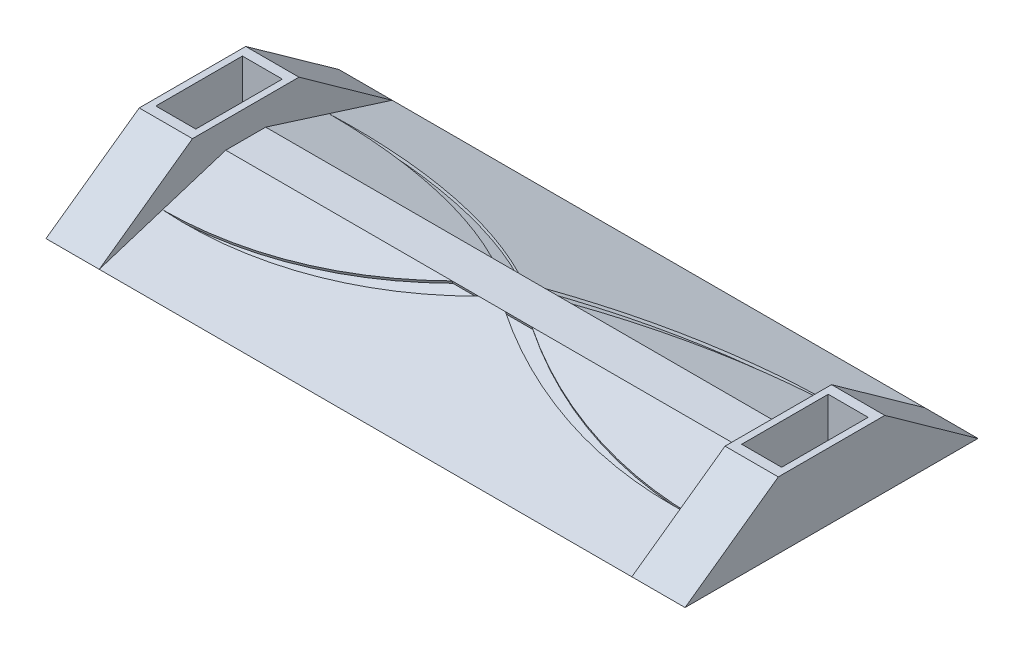
ISO-10303-21;
HEADER;
FILE_DESCRIPTION(('STEP AP214'),'2;1');
FILE_NAME('part.step','',(''),(''),'','','');
FILE_SCHEMA(('AUTOMOTIVE_DESIGN { 1 0 10303 214 1 1 1 1 }'));
ENDSEC;
DATA;
#1=APPLICATION_CONTEXT('core data for automotive mechanical design processes');
#2=APPLICATION_PROTOCOL_DEFINITION('international standard','automotive_design',2000,#1);
#3=PRODUCT_CONTEXT('',#1,'mechanical');
#4=PRODUCT('Part','Part','',(#3));
#5=PRODUCT_RELATED_PRODUCT_CATEGORY('part','',(#4));
#6=PRODUCT_DEFINITION_FORMATION('','',#4);
#7=PRODUCT_DEFINITION_CONTEXT('part definition',#1,'design');
#8=PRODUCT_DEFINITION('design','',#6,#7);
#9=PRODUCT_DEFINITION_SHAPE('','',#8);
#10=(LENGTH_UNIT() NAMED_UNIT(*) SI_UNIT(.MILLI.,.METRE.));
#11=(NAMED_UNIT(*) PLANE_ANGLE_UNIT() SI_UNIT($,.RADIAN.));
#12=(NAMED_UNIT(*) SI_UNIT($,.STERADIAN.) SOLID_ANGLE_UNIT());
#13=UNCERTAINTY_MEASURE_WITH_UNIT(LENGTH_MEASURE(1.E-05),#10,'distance_accuracy_value','');
#14=(GEOMETRIC_REPRESENTATION_CONTEXT(3) GLOBAL_UNCERTAINTY_ASSIGNED_CONTEXT((#13)) GLOBAL_UNIT_ASSIGNED_CONTEXT((#10,
#11,#12)) REPRESENTATION_CONTEXT('',''));
#15=CARTESIAN_POINT('',(0.,0.,0.));
#16=DIRECTION('',(0.,0.,1.));
#17=DIRECTION('',(1.,0.,0.));
#18=AXIS2_PLACEMENT_3D('',#15,#16,#17);
#19=CARTESIAN_POINT('',(100.,0.,-55.0000000000001));
#20=DIRECTION('',(0.,-0.953582665134142,0.301131367937097));
#21=DIRECTION('',(0.,-0.301131367937097,-0.953582665134142));
#22=AXIS2_PLACEMENT_3D('',#19,#20,#21);
#23=PLANE('',#22);
#24=DIRECTION('',(-1.,0.,0.));
#25=VECTOR('',#24,1.);
#26=CARTESIAN_POINT('',(100.,15.,-7.50000000000002));
#27=LINE('',#26,#25);
#28=CARTESIAN_POINT('',(5.,15.,-7.5));
#29=VERTEX_POINT('',#28);
#30=CARTESIAN_POINT('',(-5.,15.,-7.5));
#31=VERTEX_POINT('',#30);
#32=EDGE_CURVE('E459',#29,#31,#27,.T.);
#33=ORIENTED_EDGE('',*,*,#32,.F.);
#34=CARTESIAN_POINT('',(91.1175797884145,55.6067163312771,121.087935049044));
#35=DIRECTION('',(0.,0.953582665134142,-0.301131367937097));
#36=DIRECTION('',(0.,-0.301131367937097,-0.953582665134142));
#37=AXIS2_PLACEMENT_3D('',#34,#35,#36);
#38=CIRCLE('',#37,160.);
#39=CARTESIAN_POINT('',(100.,7.50000000000001,-31.25));
#40=VERTEX_POINT('',#39);
#41=EDGE_CURVE('E57',#40,#29,#38,.T.);
#42=ORIENTED_EDGE('',*,*,#41,.F.);
#43=DIRECTION('',(0.,0.301131367937097,0.953582665134142));
#44=VECTOR('',#43,1.);
#45=CARTESIAN_POINT('',(100.,0.,-55.0000000000001));
#46=LINE('',#45,#44);
#47=CARTESIAN_POINT('',(100.,0.,-55.));
#48=VERTEX_POINT('',#47);
#49=EDGE_CURVE('E446',#48,#40,#46,.T.);
#50=ORIENTED_EDGE('',*,*,#49,.F.);
#51=DIRECTION('',(-1.,0.,0.));
#52=VECTOR('',#51,1.);
#53=CARTESIAN_POINT('',(100.,0.,-55.0000000000001));
#54=LINE('',#53,#52);
#55=CARTESIAN_POINT('',(-100.,0.,-55.));
#56=VERTEX_POINT('',#55);
#57=EDGE_CURVE('E449',#48,#56,#54,.T.);
#58=ORIENTED_EDGE('',*,*,#57,.T.);
#59=DIRECTION('',(0.,0.301131367937097,0.953582665134142));
#60=VECTOR('',#59,1.);
#61=CARTESIAN_POINT('',(-100.,0.,-55.));
#62=LINE('',#61,#60);
#63=CARTESIAN_POINT('',(-100.,7.50000000000001,-31.25));
#64=VERTEX_POINT('',#63);
#65=EDGE_CURVE('E451',#56,#64,#62,.T.);
#66=ORIENTED_EDGE('',*,*,#65,.T.);
#67=CARTESIAN_POINT('',(-91.1175797884146,55.6067163312771,121.087935049044));
#68=DIRECTION('',(0.,0.953582665134142,-0.301131367937097));
#69=DIRECTION('',(0.,0.301131367937097,0.953582665134142));
#70=AXIS2_PLACEMENT_3D('',#67,#68,#69);
#71=CIRCLE('',#70,160.);
#72=EDGE_CURVE('E266',#31,#64,#71,.T.);
#73=ORIENTED_EDGE('',*,*,#72,.F.);
#74=EDGE_LOOP('',(#33,#42,#50,#58,#66,#73));
#75=FACE_BOUND('',#74,.T.);
#76=ADVANCED_FACE('F32',(#75),#23,.F.);
#77=CARTESIAN_POINT('',(-15.,15.,-7.5));
#78=VERTEX_POINT('',#77);
#79=CARTESIAN_POINT('',(-100.,15.,-7.49999999999997));
#80=VERTEX_POINT('',#79);
#81=EDGE_CURVE('E460',#78,#80,#27,.T.);
#82=ORIENTED_EDGE('',*,*,#81,.F.);
#83=CARTESIAN_POINT('',(-100.732632267828,55.6805137664325,121.321626927036));
#84=DIRECTION('',(0.,-0.953582665134142,0.301131367937097));
#85=DIRECTION('',(0.,0.301131367937097,0.953582665134142));
#86=AXIS2_PLACEMENT_3D('',#83,#84,#85);
#87=CIRCLE('',#86,160.);
#88=EDGE_CURVE('E49',#64,#78,#87,.T.);
#89=ORIENTED_EDGE('',*,*,#88,.F.);
#90=EDGE_CURVE('E454',#64,#80,#62,.T.);
#91=ORIENTED_EDGE('',*,*,#90,.T.);
#92=EDGE_LOOP('',(#82,#89,#91));
#93=FACE_BOUND('',#92,.T.);
#94=ADVANCED_FACE('F545',(#93),#23,.F.);
#95=CARTESIAN_POINT('',(100.,15.,7.49999999999997));
#96=DIRECTION('',(0.,-0.953582665134142,-0.301131367937098));
#97=DIRECTION('',(0.,0.301131367937098,-0.953582665134141));
#98=AXIS2_PLACEMENT_3D('',#95,#96,#97);
#99=PLANE('',#98);
#100=DIRECTION('',(-1.,0.,0.));
#101=VECTOR('',#100,1.);
#102=CARTESIAN_POINT('',(100.,15.,7.49999999999997));
#103=LINE('',#102,#101);
#104=CARTESIAN_POINT('',(5.,15.,7.50000000000001));
#105=VERTEX_POINT('',#104);
#106=CARTESIAN_POINT('',(-5.,15.,7.5));
#107=VERTEX_POINT('',#106);
#108=EDGE_CURVE('E474',#105,#107,#103,.T.);
#109=ORIENTED_EDGE('',*,*,#108,.T.);
#110=CARTESIAN_POINT('',(-91.1175797884146,55.6067163312772,-121.087935049044));
#111=DIRECTION('',(0.,0.953582665134142,0.301131367937098));
#112=DIRECTION('',(0.,0.301131367937098,-0.953582665134142));
#113=AXIS2_PLACEMENT_3D('',#110,#111,#112);
#114=CIRCLE('',#113,160.);
#115=CARTESIAN_POINT('',(-100.,7.49999999999999,31.2500000000001));
#116=VERTEX_POINT('',#115);
#117=EDGE_CURVE('E294',#116,#107,#114,.T.);
#118=ORIENTED_EDGE('',*,*,#117,.F.);
#119=DIRECTION('',(0.,-0.301131367937098,0.953582665134142));
#120=VECTOR('',#119,1.);
#121=CARTESIAN_POINT('',(-100.,15.,7.50000000000002));
#122=LINE('',#121,#120);
#123=CARTESIAN_POINT('',(-100.,0.,55.));
#124=VERTEX_POINT('',#123);
#125=EDGE_CURVE('E445',#116,#124,#122,.T.);
#126=ORIENTED_EDGE('',*,*,#125,.T.);
#127=DIRECTION('',(1.,0.,0.));
#128=VECTOR('',#127,1.);
#129=CARTESIAN_POINT('',(-100.,0.,55.));
#130=LINE('',#129,#128);
#131=CARTESIAN_POINT('',(100.,0.,55.));
#132=VERTEX_POINT('',#131);
#133=EDGE_CURVE('E36',#124,#132,#130,.T.);
#134=ORIENTED_EDGE('',*,*,#133,.T.);
#135=DIRECTION('',(0.,-0.301131367937098,0.953582665134142));
#136=VECTOR('',#135,1.);
#137=CARTESIAN_POINT('',(100.,15.,7.49999999999997));
#138=LINE('',#137,#136);
#139=CARTESIAN_POINT('',(100.,7.49999999999998,31.25));
#140=VERTEX_POINT('',#139);
#141=EDGE_CURVE('E467',#140,#132,#138,.T.);
#142=ORIENTED_EDGE('',*,*,#141,.F.);
#143=CARTESIAN_POINT('',(91.1175797884145,55.6067163312772,-121.087935049044));
#144=DIRECTION('',(0.,0.953582665134142,0.301131367937098));
#145=DIRECTION('',(0.,-0.301131367937098,0.953582665134142));
#146=AXIS2_PLACEMENT_3D('',#143,#144,#145);
#147=CIRCLE('',#146,160.);
#148=EDGE_CURVE('E260',#105,#140,#147,.T.);
#149=ORIENTED_EDGE('',*,*,#148,.F.);
#150=EDGE_LOOP('',(#109,#118,#126,#134,#142,#149));
#151=FACE_BOUND('',#150,.T.);
#152=ADVANCED_FACE('F491',(#151),#99,.F.);
#153=CARTESIAN_POINT('',(-100.,15.,7.50000000000002));
#154=VERTEX_POINT('',#153);
#155=EDGE_CURVE('E468',#154,#116,#122,.T.);
#156=ORIENTED_EDGE('',*,*,#155,.T.);
#157=CARTESIAN_POINT('',(-100.732632267828,55.6805137664326,-121.321626927036));
#158=DIRECTION('',(0.,-0.953582665134142,-0.301131367937098));
#159=DIRECTION('',(0.,-0.301131367937098,0.953582665134142));
#160=AXIS2_PLACEMENT_3D('',#157,#158,#159);
#161=CIRCLE('',#160,160.);
#162=CARTESIAN_POINT('',(-15.,15.,7.50000000000001));
#163=VERTEX_POINT('',#162);
#164=EDGE_CURVE('E287',#163,#116,#161,.T.);
#165=ORIENTED_EDGE('',*,*,#164,.F.);
#166=EDGE_CURVE('E466',#163,#154,#103,.T.);
#167=ORIENTED_EDGE('',*,*,#166,.T.);
#168=EDGE_LOOP('',(#156,#165,#167));
#169=FACE_BOUND('',#168,.T.);
#170=ADVANCED_FACE('F595',(#169),#99,.F.);
#171=CARTESIAN_POINT('',(100.,15.,7.49999999999997));
#172=VERTEX_POINT('',#171);
#173=CARTESIAN_POINT('',(15.,15.,7.50000000000001));
#174=VERTEX_POINT('',#173);
#175=EDGE_CURVE('E471',#172,#174,#103,.T.);
#176=ORIENTED_EDGE('',*,*,#175,.T.);
#177=CARTESIAN_POINT('',(100.732632267828,55.6805137664326,-121.321626927036));
#178=DIRECTION('',(0.,-0.953582665134142,-0.301131367937098));
#179=DIRECTION('',(0.,-0.301131367937098,0.953582665134142));
#180=AXIS2_PLACEMENT_3D('',#177,#178,#179);
#181=CIRCLE('',#180,160.);
#182=EDGE_CURVE('E321',#140,#174,#181,.T.);
#183=ORIENTED_EDGE('',*,*,#182,.F.);
#184=EDGE_CURVE('E463',#172,#140,#138,.T.);
#185=ORIENTED_EDGE('',*,*,#184,.F.);
#186=EDGE_LOOP('',(#176,#183,#185));
#187=FACE_BOUND('',#186,.T.);
#188=ADVANCED_FACE('F515',(#187),#99,.F.);
#189=CARTESIAN_POINT('',(0.,15.,0.));
#190=DIRECTION('',(0.,1.,0.));
#191=DIRECTION('',(0.,0.,1.));
#192=AXIS2_PLACEMENT_3D('',#189,#190,#191);
#193=PLANE('',#192);
#194=CARTESIAN_POINT('',(100.,15.,-7.49999999999997));
#195=VERTEX_POINT('',#194);
#196=CARTESIAN_POINT('',(15.,15.,-7.50000000000003));
#197=VERTEX_POINT('',#196);
#198=EDGE_CURVE('E455',#195,#197,#27,.T.);
#199=ORIENTED_EDGE('',*,*,#198,.T.);
#200=DIRECTION('',(1.,0.,0.));
#201=VECTOR('',#200,1.);
#202=CARTESIAN_POINT('',(15.,15.,-7.5));
#203=LINE('',#202,#201);
#204=EDGE_CURVE('E251',#29,#197,#203,.T.);
#205=ORIENTED_EDGE('',*,*,#204,.F.);
#206=ORIENTED_EDGE('',*,*,#32,.T.);
#207=DIRECTION('',(1.,0.,0.));
#208=VECTOR('',#207,1.);
#209=CARTESIAN_POINT('',(-5.,15.,-7.5));
#210=LINE('',#209,#208);
#211=EDGE_CURVE('E274',#78,#31,#210,.T.);
#212=ORIENTED_EDGE('',*,*,#211,.F.);
#213=ORIENTED_EDGE('',*,*,#81,.T.);
#214=DIRECTION('',(0.,0.,1.));
#215=VECTOR('',#214,1.);
#216=CARTESIAN_POINT('',(-100.,15.,-55.));
#217=LINE('',#216,#215);
#218=EDGE_CURVE('E11',#80,#154,#217,.T.);
#219=ORIENTED_EDGE('',*,*,#218,.T.);
#220=ORIENTED_EDGE('',*,*,#166,.F.);
#221=DIRECTION('',(-1.,0.,0.));
#222=VECTOR('',#221,1.);
#223=CARTESIAN_POINT('',(-15.,15.,7.50000000000001));
#224=LINE('',#223,#222);
#225=EDGE_CURVE('E296',#107,#163,#224,.T.);
#226=ORIENTED_EDGE('',*,*,#225,.F.);
#227=ORIENTED_EDGE('',*,*,#108,.F.);
#228=DIRECTION('',(-1.,0.,0.));
#229=VECTOR('',#228,1.);
#230=CARTESIAN_POINT('',(5.,15.,7.50000000000001));
#231=LINE('',#230,#229);
#232=EDGE_CURVE('E313',#174,#105,#231,.T.);
#233=ORIENTED_EDGE('',*,*,#232,.F.);
#234=ORIENTED_EDGE('',*,*,#175,.F.);
#235=DIRECTION('',(0.,0.,-1.));
#236=VECTOR('',#235,1.);
#237=CARTESIAN_POINT('',(100.,15.,-55.));
#238=LINE('',#237,#236);
#239=EDGE_CURVE('E41',#172,#195,#238,.T.);
#240=ORIENTED_EDGE('',*,*,#239,.T.);
#241=EDGE_LOOP('',(#199,#205,#206,#212,#213,#219,#220,#226,#227,#233,#234,#240));
#242=FACE_BOUND('',#241,.T.);
#243=ADVANCED_FACE('F518',(#242),#193,.T.);
#244=CARTESIAN_POINT('',(0.,0.,0.));
#245=DIRECTION('',(0.,1.,0.));
#246=DIRECTION('',(0.,0.,1.));
#247=AXIS2_PLACEMENT_3D('',#244,#245,#246);
#248=PLANE('',#247);
#249=DIRECTION('',(-1.,0.,0.));
#250=VECTOR('',#249,1.);
#251=CARTESIAN_POINT('',(-100.,0.,-55.));
#252=LINE('',#251,#250);
#253=CARTESIAN_POINT('',(120.,0.,-55.));
#254=VERTEX_POINT('',#253);
#255=EDGE_CURVE('E477',#254,#48,#252,.T.);
#256=ORIENTED_EDGE('',*,*,#255,.F.);
#257=DIRECTION('',(0.,0.,-1.));
#258=VECTOR('',#257,1.);
#259=CARTESIAN_POINT('',(120.,0.,55.));
#260=LINE('',#259,#258);
#261=CARTESIAN_POINT('',(120.,0.,55.));
#262=VERTEX_POINT('',#261);
#263=EDGE_CURVE('E433',#262,#254,#260,.T.);
#264=ORIENTED_EDGE('',*,*,#263,.F.);
#265=EDGE_CURVE('E479',#132,#262,#130,.T.);
#266=ORIENTED_EDGE('',*,*,#265,.F.);
#267=ORIENTED_EDGE('',*,*,#133,.F.);
#268=DIRECTION('',(1.,0.,0.));
#269=VECTOR('',#268,1.);
#270=CARTESIAN_POINT('',(-120.,0.,55.));
#271=LINE('',#270,#269);
#272=CARTESIAN_POINT('',(-120.,0.,55.));
#273=VERTEX_POINT('',#272);
#274=EDGE_CURVE('E399',#273,#124,#271,.T.);
#275=ORIENTED_EDGE('',*,*,#274,.F.);
#276=DIRECTION('',(0.,0.,1.));
#277=VECTOR('',#276,1.);
#278=CARTESIAN_POINT('',(-120.,0.,-55.));
#279=LINE('',#278,#277);
#280=CARTESIAN_POINT('',(-120.,0.,-55.));
#281=VERTEX_POINT('',#280);
#282=EDGE_CURVE('E393',#281,#273,#279,.T.);
#283=ORIENTED_EDGE('',*,*,#282,.F.);
#284=DIRECTION('',(1.,0.,0.));
#285=VECTOR('',#284,1.);
#286=CARTESIAN_POINT('',(-120.,0.,-55.));
#287=LINE('',#286,#285);
#288=EDGE_CURVE('E404',#281,#56,#287,.T.);
#289=ORIENTED_EDGE('',*,*,#288,.T.);
#290=ORIENTED_EDGE('',*,*,#57,.F.);
#291=EDGE_LOOP('',(#256,#264,#266,#267,#275,#283,#289,#290));
#292=FACE_BOUND('',#291,.T.);
#293=ADVANCED_FACE('F34',(#292),#248,.F.);
#294=CARTESIAN_POINT('',(100.,0.,0.));
#295=DIRECTION('',(-1.,0.,0.));
#296=DIRECTION('',(0.,0.,1.));
#297=AXIS2_PLACEMENT_3D('',#294,#295,#296);
#298=PLANE('',#297);
#299=DIRECTION('',(0.,0.581238193719098,-0.813733471206734));
#300=VECTOR('',#299,1.);
#301=CARTESIAN_POINT('',(100.,0.,55.));
#302=LINE('',#301,#300);
#303=CARTESIAN_POINT('',(100.,25.,20.0000000000001));
#304=VERTEX_POINT('',#303);
#305=EDGE_CURVE('E331',#132,#304,#302,.T.);
#306=ORIENTED_EDGE('',*,*,#305,.T.);
#307=DIRECTION('',(0.,0.,1.));
#308=VECTOR('',#307,1.);
#309=CARTESIAN_POINT('',(100.,25.,55.));
#310=LINE('',#309,#308);
#311=CARTESIAN_POINT('',(100.,25.,-20.));
#312=VERTEX_POINT('',#311);
#313=EDGE_CURVE('E458',#312,#304,#310,.T.);
#314=ORIENTED_EDGE('',*,*,#313,.F.);
#315=DIRECTION('',(0.,-0.581238193719096,-0.813733471206735));
#316=VECTOR('',#315,1.);
#317=CARTESIAN_POINT('',(100.,25.,-20.));
#318=LINE('',#317,#316);
#319=EDGE_CURVE('E341',#312,#48,#318,.T.);
#320=ORIENTED_EDGE('',*,*,#319,.T.);
#321=ORIENTED_EDGE('',*,*,#49,.T.);
#322=EDGE_CURVE('E450',#40,#195,#46,.T.);
#323=ORIENTED_EDGE('',*,*,#322,.T.);
#324=ORIENTED_EDGE('',*,*,#239,.F.);
#325=ORIENTED_EDGE('',*,*,#184,.T.);
#326=ORIENTED_EDGE('',*,*,#141,.T.);
#327=EDGE_LOOP('',(#306,#314,#320,#321,#323,#324,#325,#326));
#328=FACE_BOUND('',#327,.T.);
#329=ADVANCED_FACE('F509',(#328),#298,.T.);
#330=CARTESIAN_POINT('',(113.,25.,55.));
#331=DIRECTION('',(0.,-1.,0.));
#332=DIRECTION('',(0.,0.,-1.));
#333=AXIS2_PLACEMENT_3D('',#330,#331,#332);
#334=PLANE('',#333);
#335=DIRECTION('',(1.,0.,0.));
#336=VECTOR('',#335,1.);
#337=CARTESIAN_POINT('',(117.5,25.,16.25));
#338=LINE('',#337,#336);
#339=CARTESIAN_POINT('',(102.5,25.,16.25));
#340=VERTEX_POINT('',#339);
#341=CARTESIAN_POINT('',(117.5,25.,16.25));
#342=VERTEX_POINT('',#341);
#343=EDGE_CURVE('E423',#340,#342,#338,.T.);
#344=ORIENTED_EDGE('',*,*,#343,.F.);
#345=DIRECTION('',(0.,0.,1.));
#346=VECTOR('',#345,1.);
#347=CARTESIAN_POINT('',(102.5,25.,16.25));
#348=LINE('',#347,#346);
#349=CARTESIAN_POINT('',(102.5,25.,-16.25));
#350=VERTEX_POINT('',#349);
#351=EDGE_CURVE('E407',#350,#340,#348,.T.);
#352=ORIENTED_EDGE('',*,*,#351,.F.);
#353=DIRECTION('',(-1.,0.,0.));
#354=VECTOR('',#353,1.);
#355=CARTESIAN_POINT('',(117.5,25.,-16.25));
#356=LINE('',#355,#354);
#357=CARTESIAN_POINT('',(117.5,25.,-16.25));
#358=VERTEX_POINT('',#357);
#359=EDGE_CURVE('E412',#358,#350,#356,.T.);
#360=ORIENTED_EDGE('',*,*,#359,.F.);
#361=DIRECTION('',(0.,0.,-1.));
#362=VECTOR('',#361,1.);
#363=CARTESIAN_POINT('',(117.5,25.,16.25));
#364=LINE('',#363,#362);
#365=EDGE_CURVE('E426',#342,#358,#364,.T.);
#366=ORIENTED_EDGE('',*,*,#365,.F.);
#367=EDGE_LOOP('',(#344,#352,#360,#366));
#368=FACE_BOUND('',#367,.T.);
#369=ORIENTED_EDGE('',*,*,#313,.T.);
#370=DIRECTION('',(1.,0.,0.));
#371=VECTOR('',#370,1.);
#372=CARTESIAN_POINT('',(100.,25.,20.0000000000001));
#373=LINE('',#372,#371);
#374=CARTESIAN_POINT('',(120.,25.,20.0000000000001));
#375=VERTEX_POINT('',#374);
#376=EDGE_CURVE('E334',#304,#375,#373,.T.);
#377=ORIENTED_EDGE('',*,*,#376,.T.);
#378=DIRECTION('',(0.,0.,1.));
#379=VECTOR('',#378,1.);
#380=CARTESIAN_POINT('',(120.,25.,55.));
#381=LINE('',#380,#379);
#382=CARTESIAN_POINT('',(120.,25.,-20.));
#383=VERTEX_POINT('',#382);
#384=EDGE_CURVE('E442',#383,#375,#381,.T.);
#385=ORIENTED_EDGE('',*,*,#384,.F.);
#386=DIRECTION('',(1.,0.,0.));
#387=VECTOR('',#386,1.);
#388=CARTESIAN_POINT('',(100.,25.,-20.));
#389=LINE('',#388,#387);
#390=EDGE_CURVE('E337',#312,#383,#389,.T.);
#391=ORIENTED_EDGE('',*,*,#390,.F.);
#392=EDGE_LOOP('',(#369,#377,#385,#391));
#393=FACE_BOUND('',#392,.T.);
#394=ADVANCED_FACE('F505',(#368,#393),#334,.F.);
#395=ORIENTED_EDGE('',*,*,#322,.F.);
#396=CARTESIAN_POINT('',(100.732632267828,55.6805137664325,121.321626927036));
#397=DIRECTION('',(0.,-0.953582665134142,0.301131367937097));
#398=DIRECTION('',(0.,0.301131367937097,0.953582665134142));
#399=AXIS2_PLACEMENT_3D('',#396,#397,#398);
#400=CIRCLE('',#399,160.);
#401=EDGE_CURVE('E248',#197,#40,#400,.T.);
#402=ORIENTED_EDGE('',*,*,#401,.F.);
#403=ORIENTED_EDGE('',*,*,#198,.F.);
#404=EDGE_LOOP('',(#395,#402,#403));
#405=FACE_BOUND('',#404,.T.);
#406=ADVANCED_FACE('F548',(#405),#23,.F.);
#407=CARTESIAN_POINT('',(120.,0.,0.));
#408=DIRECTION('',(-1.,0.,0.));
#409=DIRECTION('',(0.,0.,1.));
#410=AXIS2_PLACEMENT_3D('',#407,#408,#409);
#411=PLANE('',#410);
#412=ORIENTED_EDGE('',*,*,#384,.T.);
#413=DIRECTION('',(0.,0.581238193719098,-0.813733471206734));
#414=VECTOR('',#413,1.);
#415=CARTESIAN_POINT('',(120.,0.,55.));
#416=LINE('',#415,#414);
#417=EDGE_CURVE('E335',#262,#375,#416,.T.);
#418=ORIENTED_EDGE('',*,*,#417,.F.);
#419=ORIENTED_EDGE('',*,*,#263,.T.);
#420=DIRECTION('',(0.,-0.581238193719096,-0.813733471206735));
#421=VECTOR('',#420,1.);
#422=CARTESIAN_POINT('',(120.,25.,-20.));
#423=LINE('',#422,#421);
#424=EDGE_CURVE('E304',#383,#254,#423,.T.);
#425=ORIENTED_EDGE('',*,*,#424,.F.);
#426=EDGE_LOOP('',(#412,#418,#419,#425));
#427=FACE_BOUND('',#426,.T.);
#428=ADVANCED_FACE('F501',(#427),#411,.F.);
#429=CARTESIAN_POINT('',(102.5,7.5,16.25));
#430=DIRECTION('',(-1.,0.,0.));
#431=DIRECTION('',(0.,0.,1.));
#432=AXIS2_PLACEMENT_3D('',#429,#430,#431);
#433=PLANE('',#432);
#434=ORIENTED_EDGE('',*,*,#351,.T.);
#435=DIRECTION('',(0.,1.,0.));
#436=VECTOR('',#435,1.);
#437=CARTESIAN_POINT('',(102.5,7.5,16.25));
#438=LINE('',#437,#436);
#439=CARTESIAN_POINT('',(102.5,7.5,16.25));
#440=VERTEX_POINT('',#439);
#441=EDGE_CURVE('E421',#440,#340,#438,.T.);
#442=ORIENTED_EDGE('',*,*,#441,.F.);
#443=DIRECTION('',(0.,0.,1.));
#444=VECTOR('',#443,1.);
#445=CARTESIAN_POINT('',(102.5,7.5,16.25));
#446=LINE('',#445,#444);
#447=CARTESIAN_POINT('',(102.5,7.5,-16.25));
#448=VERTEX_POINT('',#447);
#449=EDGE_CURVE('E408',#448,#440,#446,.T.);
#450=ORIENTED_EDGE('',*,*,#449,.F.);
#451=DIRECTION('',(0.,1.,0.));
#452=VECTOR('',#451,1.);
#453=CARTESIAN_POINT('',(102.5,7.5,-16.25));
#454=LINE('',#453,#452);
#455=EDGE_CURVE('E431',#448,#350,#454,.T.);
#456=ORIENTED_EDGE('',*,*,#455,.T.);
#457=EDGE_LOOP('',(#434,#442,#450,#456));
#458=FACE_BOUND('',#457,.T.);
#459=ADVANCED_FACE('F561',(#458),#433,.F.);
#460=CARTESIAN_POINT('',(117.5,7.5,-16.25));
#461=DIRECTION('',(0.,0.,-1.));
#462=DIRECTION('',(-1.,0.,0.));
#463=AXIS2_PLACEMENT_3D('',#460,#461,#462);
#464=PLANE('',#463);
#465=ORIENTED_EDGE('',*,*,#359,.T.);
#466=ORIENTED_EDGE('',*,*,#455,.F.);
#467=DIRECTION('',(-1.,0.,0.));
#468=VECTOR('',#467,1.);
#469=CARTESIAN_POINT('',(117.5,7.5,-16.25));
#470=LINE('',#469,#468);
#471=CARTESIAN_POINT('',(117.5,7.5,-16.25));
#472=VERTEX_POINT('',#471);
#473=EDGE_CURVE('E418',#472,#448,#470,.T.);
#474=ORIENTED_EDGE('',*,*,#473,.F.);
#475=DIRECTION('',(0.,1.,0.));
#476=VECTOR('',#475,1.);
#477=CARTESIAN_POINT('',(117.5,7.5,-16.25));
#478=LINE('',#477,#476);
#479=EDGE_CURVE('E434',#472,#358,#478,.T.);
#480=ORIENTED_EDGE('',*,*,#479,.T.);
#481=EDGE_LOOP('',(#465,#466,#474,#480));
#482=FACE_BOUND('',#481,.T.);
#483=ADVANCED_FACE('F911',(#482),#464,.F.);
#484=CARTESIAN_POINT('',(117.5,7.5,16.25));
#485=DIRECTION('',(1.,0.,0.));
#486=DIRECTION('',(0.,0.,-1.));
#487=AXIS2_PLACEMENT_3D('',#484,#485,#486);
#488=PLANE('',#487);
#489=ORIENTED_EDGE('',*,*,#365,.T.);
#490=ORIENTED_EDGE('',*,*,#479,.F.);
#491=DIRECTION('',(0.,0.,-1.));
#492=VECTOR('',#491,1.);
#493=CARTESIAN_POINT('',(117.5,7.5,16.25));
#494=LINE('',#493,#492);
#495=CARTESIAN_POINT('',(117.5,7.5,16.25));
#496=VERTEX_POINT('',#495);
#497=EDGE_CURVE('E415',#496,#472,#494,.T.);
#498=ORIENTED_EDGE('',*,*,#497,.F.);
#499=DIRECTION('',(0.,1.,0.));
#500=VECTOR('',#499,1.);
#501=CARTESIAN_POINT('',(117.5,7.5,16.25));
#502=LINE('',#501,#500);
#503=EDGE_CURVE('E436',#496,#342,#502,.T.);
#504=ORIENTED_EDGE('',*,*,#503,.T.);
#505=EDGE_LOOP('',(#489,#490,#498,#504));
#506=FACE_BOUND('',#505,.T.);
#507=ADVANCED_FACE('F914',(#506),#488,.F.);
#508=CARTESIAN_POINT('',(117.5,7.5,16.25));
#509=DIRECTION('',(0.,0.,1.));
#510=DIRECTION('',(1.,0.,0.));
#511=AXIS2_PLACEMENT_3D('',#508,#509,#510);
#512=PLANE('',#511);
#513=ORIENTED_EDGE('',*,*,#343,.T.);
#514=ORIENTED_EDGE('',*,*,#503,.F.);
#515=DIRECTION('',(1.,0.,0.));
#516=VECTOR('',#515,1.);
#517=CARTESIAN_POINT('',(117.5,7.5,16.25));
#518=LINE('',#517,#516);
#519=EDGE_CURVE('E411',#440,#496,#518,.T.);
#520=ORIENTED_EDGE('',*,*,#519,.F.);
#521=ORIENTED_EDGE('',*,*,#441,.T.);
#522=EDGE_LOOP('',(#513,#514,#520,#521));
#523=FACE_BOUND('',#522,.T.);
#524=ADVANCED_FACE('F909',(#523),#512,.F.);
#525=CARTESIAN_POINT('',(0.,7.5,0.));
#526=DIRECTION('',(0.,1.,0.));
#527=DIRECTION('',(0.,0.,1.));
#528=AXIS2_PLACEMENT_3D('',#525,#526,#527);
#529=PLANE('',#528);
#530=ORIENTED_EDGE('',*,*,#449,.T.);
#531=ORIENTED_EDGE('',*,*,#519,.T.);
#532=ORIENTED_EDGE('',*,*,#497,.T.);
#533=ORIENTED_EDGE('',*,*,#473,.T.);
#534=EDGE_LOOP('',(#530,#531,#532,#533));
#535=FACE_BOUND('',#534,.T.);
#536=ADVANCED_FACE('F675',(#535),#529,.T.);
#537=CARTESIAN_POINT('',(-100.,0.,0.));
#538=DIRECTION('',(1.,0.,0.));
#539=DIRECTION('',(0.,0.,-1.));
#540=AXIS2_PLACEMENT_3D('',#537,#538,#539);
#541=PLANE('',#540);
#542=DIRECTION('',(0.,-0.581238193719096,0.813733471206735));
#543=VECTOR('',#542,1.);
#544=CARTESIAN_POINT('',(-100.,25.,20.));
#545=LINE('',#544,#543);
#546=CARTESIAN_POINT('',(-100.,25.,20.));
#547=VERTEX_POINT('',#546);
#548=EDGE_CURVE('E346',#547,#124,#545,.T.);
#549=ORIENTED_EDGE('',*,*,#548,.T.);
#550=ORIENTED_EDGE('',*,*,#125,.F.);
#551=ORIENTED_EDGE('',*,*,#155,.F.);
#552=ORIENTED_EDGE('',*,*,#218,.F.);
#553=ORIENTED_EDGE('',*,*,#90,.F.);
#554=ORIENTED_EDGE('',*,*,#65,.F.);
#555=DIRECTION('',(0.,0.581238193719096,0.813733471206735));
#556=VECTOR('',#555,1.);
#557=CARTESIAN_POINT('',(-100.,0.,-55.));
#558=LINE('',#557,#556);
#559=CARTESIAN_POINT('',(-100.,25.,-20.));
#560=VERTEX_POINT('',#559);
#561=EDGE_CURVE('E355',#56,#560,#558,.T.);
#562=ORIENTED_EDGE('',*,*,#561,.T.);
#563=DIRECTION('',(0.,0.,-1.));
#564=VECTOR('',#563,1.);
#565=CARTESIAN_POINT('',(-100.,25.,-55.));
#566=LINE('',#565,#564);
#567=EDGE_CURVE('E386',#547,#560,#566,.T.);
#568=ORIENTED_EDGE('',*,*,#567,.F.);
#569=EDGE_LOOP('',(#549,#550,#551,#552,#553,#554,#562,#568));
#570=FACE_BOUND('',#569,.T.);
#571=ADVANCED_FACE('F581',(#570),#541,.T.);
#572=CARTESIAN_POINT('',(-120.,25.,-55.));
#573=DIRECTION('',(0.,-1.,0.));
#574=DIRECTION('',(0.,0.,-1.));
#575=AXIS2_PLACEMENT_3D('',#572,#573,#574);
#576=PLANE('',#575);
#577=DIRECTION('',(-1.,0.,0.));
#578=VECTOR('',#577,1.);
#579=CARTESIAN_POINT('',(-117.5,25.,-16.25));
#580=LINE('',#579,#578);
#581=CARTESIAN_POINT('',(-102.5,25.,-16.25));
#582=VERTEX_POINT('',#581);
#583=CARTESIAN_POINT('',(-117.5,25.,-16.25));
#584=VERTEX_POINT('',#583);
#585=EDGE_CURVE('E376',#582,#584,#580,.T.);
#586=ORIENTED_EDGE('',*,*,#585,.F.);
#587=DIRECTION('',(0.,0.,-1.));
#588=VECTOR('',#587,1.);
#589=CARTESIAN_POINT('',(-102.5,25.,16.25));
#590=LINE('',#589,#588);
#591=CARTESIAN_POINT('',(-102.5,25.,16.25));
#592=VERTEX_POINT('',#591);
#593=EDGE_CURVE('E354',#592,#582,#590,.T.);
#594=ORIENTED_EDGE('',*,*,#593,.F.);
#595=DIRECTION('',(1.,0.,0.));
#596=VECTOR('',#595,1.);
#597=CARTESIAN_POINT('',(-117.5,25.,16.25));
#598=LINE('',#597,#596);
#599=CARTESIAN_POINT('',(-117.5,25.,16.25));
#600=VERTEX_POINT('',#599);
#601=EDGE_CURVE('E365',#600,#592,#598,.T.);
#602=ORIENTED_EDGE('',*,*,#601,.F.);
#603=DIRECTION('',(0.,0.,1.));
#604=VECTOR('',#603,1.);
#605=CARTESIAN_POINT('',(-117.5,25.,16.25));
#606=LINE('',#605,#604);
#607=EDGE_CURVE('E379',#584,#600,#606,.T.);
#608=ORIENTED_EDGE('',*,*,#607,.F.);
#609=EDGE_LOOP('',(#586,#594,#602,#608));
#610=FACE_BOUND('',#609,.T.);
#611=DIRECTION('',(0.,0.,-1.));
#612=VECTOR('',#611,1.);
#613=CARTESIAN_POINT('',(-120.,25.,-55.));
#614=LINE('',#613,#612);
#615=CARTESIAN_POINT('',(-120.,25.,20.0000000000001));
#616=VERTEX_POINT('',#615);
#617=CARTESIAN_POINT('',(-120.,25.,-20.));
#618=VERTEX_POINT('',#617);
#619=EDGE_CURVE('E396',#616,#618,#614,.T.);
#620=ORIENTED_EDGE('',*,*,#619,.F.);
#621=DIRECTION('',(-1.,0.,0.));
#622=VECTOR('',#621,1.);
#623=CARTESIAN_POINT('',(-100.,25.,20.));
#624=LINE('',#623,#622);
#625=EDGE_CURVE('E349',#547,#616,#624,.T.);
#626=ORIENTED_EDGE('',*,*,#625,.F.);
#627=ORIENTED_EDGE('',*,*,#567,.T.);
#628=DIRECTION('',(-1.,0.,0.));
#629=VECTOR('',#628,1.);
#630=CARTESIAN_POINT('',(-100.,25.,-20.));
#631=LINE('',#630,#629);
#632=EDGE_CURVE('E352',#560,#618,#631,.T.);
#633=ORIENTED_EDGE('',*,*,#632,.T.);
#634=EDGE_LOOP('',(#620,#626,#627,#633));
#635=FACE_BOUND('',#634,.T.);
#636=ADVANCED_FACE('F578',(#610,#635),#576,.F.);
#637=CARTESIAN_POINT('',(-120.,0.,0.));
#638=DIRECTION('',(1.,0.,0.));
#639=DIRECTION('',(0.,0.,-1.));
#640=AXIS2_PLACEMENT_3D('',#637,#638,#639);
#641=PLANE('',#640);
#642=ORIENTED_EDGE('',*,*,#282,.T.);
#643=DIRECTION('',(0.,-0.581238193719096,0.813733471206735));
#644=VECTOR('',#643,1.);
#645=CARTESIAN_POINT('',(-120.,25.,20.));
#646=LINE('',#645,#644);
#647=EDGE_CURVE('E350',#616,#273,#646,.T.);
#648=ORIENTED_EDGE('',*,*,#647,.F.);
#649=ORIENTED_EDGE('',*,*,#619,.T.);
#650=DIRECTION('',(0.,0.581238193719096,0.813733471206735));
#651=VECTOR('',#650,1.);
#652=CARTESIAN_POINT('',(-120.,0.,-55.));
#653=LINE('',#652,#651);
#654=EDGE_CURVE('E340',#281,#618,#653,.T.);
#655=ORIENTED_EDGE('',*,*,#654,.F.);
#656=EDGE_LOOP('',(#642,#648,#649,#655));
#657=FACE_BOUND('',#656,.T.);
#658=ADVANCED_FACE('F573',(#657),#641,.F.);
#659=CARTESIAN_POINT('',(-102.5,7.5,16.25));
#660=DIRECTION('',(1.,0.,0.));
#661=DIRECTION('',(0.,0.,-1.));
#662=AXIS2_PLACEMENT_3D('',#659,#660,#661);
#663=PLANE('',#662);
#664=ORIENTED_EDGE('',*,*,#593,.T.);
#665=DIRECTION('',(0.,1.,0.));
#666=VECTOR('',#665,1.);
#667=CARTESIAN_POINT('',(-102.5,7.5,-16.25));
#668=LINE('',#667,#666);
#669=CARTESIAN_POINT('',(-102.5,7.5,-16.25));
#670=VERTEX_POINT('',#669);
#671=EDGE_CURVE('E374',#670,#582,#668,.T.);
#672=ORIENTED_EDGE('',*,*,#671,.F.);
#673=DIRECTION('',(0.,0.,-1.));
#674=VECTOR('',#673,1.);
#675=CARTESIAN_POINT('',(-102.5,7.5,16.25));
#676=LINE('',#675,#674);
#677=CARTESIAN_POINT('',(-102.5,7.5,16.25));
#678=VERTEX_POINT('',#677);
#679=EDGE_CURVE('E361',#678,#670,#676,.T.);
#680=ORIENTED_EDGE('',*,*,#679,.F.);
#681=DIRECTION('',(0.,1.,0.));
#682=VECTOR('',#681,1.);
#683=CARTESIAN_POINT('',(-102.5,7.5,16.25));
#684=LINE('',#683,#682);
#685=EDGE_CURVE('E384',#678,#592,#684,.T.);
#686=ORIENTED_EDGE('',*,*,#685,.T.);
#687=EDGE_LOOP('',(#664,#672,#680,#686));
#688=FACE_BOUND('',#687,.T.);
#689=ADVANCED_FACE('F765',(#688),#663,.F.);
#690=CARTESIAN_POINT('',(-117.5,7.5,16.25));
#691=DIRECTION('',(0.,0.,1.));
#692=DIRECTION('',(1.,0.,0.));
#693=AXIS2_PLACEMENT_3D('',#690,#691,#692);
#694=PLANE('',#693);
#695=ORIENTED_EDGE('',*,*,#601,.T.);
#696=ORIENTED_EDGE('',*,*,#685,.F.);
#697=DIRECTION('',(1.,0.,0.));
#698=VECTOR('',#697,1.);
#699=CARTESIAN_POINT('',(-117.5,7.5,16.25));
#700=LINE('',#699,#698);
#701=CARTESIAN_POINT('',(-117.5,7.5,16.25));
#702=VERTEX_POINT('',#701);
#703=EDGE_CURVE('E371',#702,#678,#700,.T.);
#704=ORIENTED_EDGE('',*,*,#703,.F.);
#705=DIRECTION('',(0.,1.,0.));
#706=VECTOR('',#705,1.);
#707=CARTESIAN_POINT('',(-117.5,7.5,16.25));
#708=LINE('',#707,#706);
#709=EDGE_CURVE('E387',#702,#600,#708,.T.);
#710=ORIENTED_EDGE('',*,*,#709,.T.);
#711=EDGE_LOOP('',(#695,#696,#704,#710));
#712=FACE_BOUND('',#711,.T.);
#713=ADVANCED_FACE('F773',(#712),#694,.F.);
#714=CARTESIAN_POINT('',(-117.5,7.5,16.25));
#715=DIRECTION('',(-1.,0.,0.));
#716=DIRECTION('',(0.,0.,1.));
#717=AXIS2_PLACEMENT_3D('',#714,#715,#716);
#718=PLANE('',#717);
#719=ORIENTED_EDGE('',*,*,#607,.T.);
#720=ORIENTED_EDGE('',*,*,#709,.F.);
#721=DIRECTION('',(0.,0.,1.));
#722=VECTOR('',#721,1.);
#723=CARTESIAN_POINT('',(-117.5,7.5,16.25));
#724=LINE('',#723,#722);
#725=CARTESIAN_POINT('',(-117.5,7.5,-16.25));
#726=VERTEX_POINT('',#725);
#727=EDGE_CURVE('E368',#726,#702,#724,.T.);
#728=ORIENTED_EDGE('',*,*,#727,.F.);
#729=DIRECTION('',(0.,1.,0.));
#730=VECTOR('',#729,1.);
#731=CARTESIAN_POINT('',(-117.5,7.5,-16.25));
#732=LINE('',#731,#730);
#733=EDGE_CURVE('E389',#726,#584,#732,.T.);
#734=ORIENTED_EDGE('',*,*,#733,.T.);
#735=EDGE_LOOP('',(#719,#720,#728,#734));
#736=FACE_BOUND('',#735,.T.);
#737=ADVANCED_FACE('F781',(#736),#718,.F.);
#738=CARTESIAN_POINT('',(-117.5,7.5,-16.25));
#739=DIRECTION('',(0.,0.,-1.));
#740=DIRECTION('',(-1.,0.,0.));
#741=AXIS2_PLACEMENT_3D('',#738,#739,#740);
#742=PLANE('',#741);
#743=ORIENTED_EDGE('',*,*,#585,.T.);
#744=ORIENTED_EDGE('',*,*,#733,.F.);
#745=DIRECTION('',(-1.,0.,0.));
#746=VECTOR('',#745,1.);
#747=CARTESIAN_POINT('',(-117.5,7.5,-16.25));
#748=LINE('',#747,#746);
#749=EDGE_CURVE('E364',#670,#726,#748,.T.);
#750=ORIENTED_EDGE('',*,*,#749,.F.);
#751=ORIENTED_EDGE('',*,*,#671,.T.);
#752=EDGE_LOOP('',(#743,#744,#750,#751));
#753=FACE_BOUND('',#752,.T.);
#754=ADVANCED_FACE('F789',(#753),#742,.F.);
#755=CARTESIAN_POINT('',(0.,7.5,0.));
#756=DIRECTION('',(0.,-1.,0.));
#757=DIRECTION('',(0.,0.,-1.));
#758=AXIS2_PLACEMENT_3D('',#755,#756,#757);
#759=PLANE('',#758);
#760=ORIENTED_EDGE('',*,*,#679,.T.);
#761=ORIENTED_EDGE('',*,*,#749,.T.);
#762=ORIENTED_EDGE('',*,*,#727,.T.);
#763=ORIENTED_EDGE('',*,*,#703,.T.);
#764=EDGE_LOOP('',(#760,#761,#762,#763));
#765=FACE_BOUND('',#764,.T.);
#766=ADVANCED_FACE('F797',(#765),#759,.F.);
#767=CARTESIAN_POINT('',(-100.,0.,-55.));
#768=DIRECTION('',(0.,-0.813733471206735,0.581238193719096));
#769=DIRECTION('',(0.,-0.581238193719096,-0.813733471206735));
#770=AXIS2_PLACEMENT_3D('',#767,#768,#769);
#771=PLANE('',#770);
#772=ORIENTED_EDGE('',*,*,#654,.T.);
#773=ORIENTED_EDGE('',*,*,#632,.F.);
#774=ORIENTED_EDGE('',*,*,#561,.F.);
#775=ORIENTED_EDGE('',*,*,#288,.F.);
#776=EDGE_LOOP('',(#772,#773,#774,#775));
#777=FACE_BOUND('',#776,.T.);
#778=ADVANCED_FACE('F570',(#777),#771,.F.);
#779=CARTESIAN_POINT('',(-100.,25.,20.));
#780=DIRECTION('',(0.,-0.813733471206735,-0.581238193719096));
#781=DIRECTION('',(0.,0.581238193719096,-0.813733471206735));
#782=AXIS2_PLACEMENT_3D('',#779,#780,#781);
#783=PLANE('',#782);
#784=ORIENTED_EDGE('',*,*,#647,.T.);
#785=ORIENTED_EDGE('',*,*,#274,.T.);
#786=ORIENTED_EDGE('',*,*,#548,.F.);
#787=ORIENTED_EDGE('',*,*,#625,.T.);
#788=EDGE_LOOP('',(#784,#785,#786,#787));
#789=FACE_BOUND('',#788,.T.);
#790=ADVANCED_FACE('F810',(#789),#783,.F.);
#791=CARTESIAN_POINT('',(100.,25.,-20.));
#792=DIRECTION('',(0.,-0.813733471206735,0.581238193719096));
#793=DIRECTION('',(0.,-0.581238193719096,-0.813733471206735));
#794=AXIS2_PLACEMENT_3D('',#791,#792,#793);
#795=PLANE('',#794);
#796=ORIENTED_EDGE('',*,*,#424,.T.);
#797=ORIENTED_EDGE('',*,*,#255,.T.);
#798=ORIENTED_EDGE('',*,*,#319,.F.);
#799=ORIENTED_EDGE('',*,*,#390,.T.);
#800=EDGE_LOOP('',(#796,#797,#798,#799));
#801=FACE_BOUND('',#800,.T.);
#802=ADVANCED_FACE('F817',(#801),#795,.F.);
#803=CARTESIAN_POINT('',(100.,0.,55.));
#804=DIRECTION('',(0.,-0.813733471206734,-0.581238193719098));
#805=DIRECTION('',(0.,0.581238193719098,-0.813733471206734));
#806=AXIS2_PLACEMENT_3D('',#803,#804,#805);
#807=PLANE('',#806);
#808=ORIENTED_EDGE('',*,*,#417,.T.);
#809=ORIENTED_EDGE('',*,*,#376,.F.);
#810=ORIENTED_EDGE('',*,*,#305,.F.);
#811=ORIENTED_EDGE('',*,*,#265,.T.);
#812=EDGE_LOOP('',(#808,#809,#810,#811));
#813=FACE_BOUND('',#812,.T.);
#814=ADVANCED_FACE('F503',(#813),#807,.F.);
#815=CARTESIAN_POINT('',(91.1175797884145,54.6531336661431,-121.389066416981));
#816=DIRECTION('',(0.,0.953582665134142,0.301131367937098));
#817=DIRECTION('',(0.,-0.301131367937098,0.953582665134142));
#818=AXIS2_PLACEMENT_3D('',#815,#816,#817);
#819=CYLINDRICAL_SURFACE('',#818,160.);
#820=ORIENTED_EDGE('',*,*,#148,.T.);
#821=DIRECTION('',(0.,0.953582665134142,0.301131367937098));
#822=VECTOR('',#821,1.);
#823=CARTESIAN_POINT('',(100.,6.54641733486585,30.9488686320629));
#824=LINE('',#823,#822);
#825=CARTESIAN_POINT('',(100.,6.54641733486585,30.9488686320629));
#826=VERTEX_POINT('',#825);
#827=EDGE_CURVE('E319',#826,#140,#824,.T.);
#828=ORIENTED_EDGE('',*,*,#827,.F.);
#829=CARTESIAN_POINT('',(91.1175797884145,54.6531336661431,-121.389066416981));
#830=DIRECTION('',(0.,0.953582665134142,0.301131367937098));
#831=DIRECTION('',(0.,-0.301131367937098,0.953582665134142));
#832=AXIS2_PLACEMENT_3D('',#829,#830,#831);
#833=CIRCLE('',#832,160.);
#834=CARTESIAN_POINT('',(5.,14.0464173348659,7.19886863206291));
#835=VERTEX_POINT('',#834);
#836=EDGE_CURVE('E309',#835,#826,#833,.T.);
#837=ORIENTED_EDGE('',*,*,#836,.F.);
#838=DIRECTION('',(0.,0.953582665134142,0.301131367937098));
#839=VECTOR('',#838,1.);
#840=CARTESIAN_POINT('',(5.,14.0464173348659,7.19886863206291));
#841=LINE('',#840,#839);
#842=EDGE_CURVE('E297',#835,#105,#841,.T.);
#843=ORIENTED_EDGE('',*,*,#842,.T.);
#844=EDGE_LOOP('',(#820,#828,#837,#843));
#845=FACE_BOUND('',#844,.T.);
#846=ADVANCED_FACE('F526',(#845),#819,.F.);
#847=CARTESIAN_POINT('',(5.,14.0464173348659,7.19886863206291));
#848=DIRECTION('',(0.,0.301131367937098,-0.953582665134142));
#849=DIRECTION('',(0.,0.953582665134142,0.301131367937098));
#850=AXIS2_PLACEMENT_3D('',#847,#848,#849);
#851=PLANE('',#850);
#852=ORIENTED_EDGE('',*,*,#232,.T.);
#853=ORIENTED_EDGE('',*,*,#842,.F.);
#854=DIRECTION('',(-1.,0.,0.));
#855=VECTOR('',#854,1.);
#856=CARTESIAN_POINT('',(5.,14.0464173348659,7.19886863206291));
#857=LINE('',#856,#855);
#858=CARTESIAN_POINT('',(15.,14.0464173348659,7.19886863206291));
#859=VERTEX_POINT('',#858);
#860=EDGE_CURVE('E316',#859,#835,#857,.T.);
#861=ORIENTED_EDGE('',*,*,#860,.F.);
#862=DIRECTION('',(0.,0.953582665134142,0.301131367937098));
#863=VECTOR('',#862,1.);
#864=CARTESIAN_POINT('',(15.,14.0464173348659,7.19886863206291));
#865=LINE('',#864,#863);
#866=EDGE_CURVE('E327',#859,#174,#865,.T.);
#867=ORIENTED_EDGE('',*,*,#866,.T.);
#868=EDGE_LOOP('',(#852,#853,#861,#867));
#869=FACE_BOUND('',#868,.T.);
#870=ADVANCED_FACE('F522',(#869),#851,.F.);
#871=CARTESIAN_POINT('',(100.732632267828,54.7269311012984,-121.622758294973));
#872=DIRECTION('',(0.,0.953582665134142,0.301131367937098));
#873=DIRECTION('',(0.,-0.301131367937098,0.953582665134142));
#874=AXIS2_PLACEMENT_3D('',#871,#872,#873);
#875=CYLINDRICAL_SURFACE('',#874,160.);
#876=ORIENTED_EDGE('',*,*,#182,.T.);
#877=ORIENTED_EDGE('',*,*,#866,.F.);
#878=CARTESIAN_POINT('',(100.732632267828,54.7269311012984,-121.622758294973));
#879=DIRECTION('',(0.,-0.953582665134142,-0.301131367937098));
#880=DIRECTION('',(0.,-0.301131367937098,0.953582665134142));
#881=AXIS2_PLACEMENT_3D('',#878,#879,#880);
#882=CIRCLE('',#881,160.);
#883=EDGE_CURVE('E312',#826,#859,#882,.T.);
#884=ORIENTED_EDGE('',*,*,#883,.F.);
#885=ORIENTED_EDGE('',*,*,#827,.T.);
#886=EDGE_LOOP('',(#876,#877,#884,#885));
#887=FACE_BOUND('',#886,.T.);
#888=ADVANCED_FACE('F529',(#887),#875,.T.);
#889=CARTESIAN_POINT('',(91.1175797884145,54.6531336661431,-121.389066416981));
#890=DIRECTION('',(0.,0.953582665134142,0.301131367937098));
#891=DIRECTION('',(0.,-0.301131367937098,0.953582665134142));
#892=AXIS2_PLACEMENT_3D('',#889,#890,#891);
#893=PLANE('',#892);
#894=ORIENTED_EDGE('',*,*,#836,.T.);
#895=ORIENTED_EDGE('',*,*,#883,.T.);
#896=ORIENTED_EDGE('',*,*,#860,.T.);
#897=EDGE_LOOP('',(#894,#895,#896));
#898=FACE_BOUND('',#897,.T.);
#899=ADVANCED_FACE('F531',(#898),#893,.T.);
#900=CARTESIAN_POINT('',(-91.1175797884146,54.6531336661431,-121.389066416981));
#901=DIRECTION('',(0.,0.953582665134142,0.301131367937098));
#902=DIRECTION('',(0.,-0.301131367937098,0.953582665134142));
#903=AXIS2_PLACEMENT_3D('',#900,#901,#902);
#904=CYLINDRICAL_SURFACE('',#903,160.);
#905=ORIENTED_EDGE('',*,*,#117,.T.);
#906=DIRECTION('',(0.,0.953582665134142,0.301131367937098));
#907=VECTOR('',#906,1.);
#908=CARTESIAN_POINT('',(-5.,14.0464173348659,7.19886863206291));
#909=LINE('',#908,#907);
#910=CARTESIAN_POINT('',(-5.,14.0464173348659,7.19886863206291));
#911=VERTEX_POINT('',#910);
#912=EDGE_CURVE('E293',#911,#107,#909,.T.);
#913=ORIENTED_EDGE('',*,*,#912,.F.);
#914=CARTESIAN_POINT('',(-91.1175797884146,54.6531336661431,-121.389066416981));
#915=DIRECTION('',(0.,0.953582665134142,0.301131367937098));
#916=DIRECTION('',(0.,0.301131367937098,-0.953582665134142));
#917=AXIS2_PLACEMENT_3D('',#914,#915,#916);
#918=CIRCLE('',#917,160.);
#919=CARTESIAN_POINT('',(-100.,6.54641733486585,30.948868632063));
#920=VERTEX_POINT('',#919);
#921=EDGE_CURVE('E283',#920,#911,#918,.T.);
#922=ORIENTED_EDGE('',*,*,#921,.F.);
#923=DIRECTION('',(0.,0.953582665134142,0.301131367937098));
#924=VECTOR('',#923,1.);
#925=CARTESIAN_POINT('',(-100.,6.54641733486585,30.948868632063));
#926=LINE('',#925,#924);
#927=EDGE_CURVE('E302',#920,#116,#926,.T.);
#928=ORIENTED_EDGE('',*,*,#927,.T.);
#929=EDGE_LOOP('',(#905,#913,#922,#928));
#930=FACE_BOUND('',#929,.T.);
#931=ADVANCED_FACE('F533',(#930),#904,.F.);
#932=CARTESIAN_POINT('',(-100.732632267828,54.7269311012984,-121.622758294973));
#933=DIRECTION('',(0.,0.953582665134142,0.301131367937098));
#934=DIRECTION('',(0.,-0.301131367937098,0.953582665134142));
#935=AXIS2_PLACEMENT_3D('',#932,#933,#934);
#936=CYLINDRICAL_SURFACE('',#935,160.);
#937=ORIENTED_EDGE('',*,*,#164,.T.);
#938=ORIENTED_EDGE('',*,*,#927,.F.);
#939=CARTESIAN_POINT('',(-100.732632267828,54.7269311012984,-121.622758294973));
#940=DIRECTION('',(0.,-0.953582665134142,-0.301131367937098));
#941=DIRECTION('',(0.,-0.301131367937098,0.953582665134142));
#942=AXIS2_PLACEMENT_3D('',#939,#940,#941);
#943=CIRCLE('',#942,160.);
#944=CARTESIAN_POINT('',(-15.,14.0464173348659,7.19886863206291));
#945=VERTEX_POINT('',#944);
#946=EDGE_CURVE('E290',#945,#920,#943,.T.);
#947=ORIENTED_EDGE('',*,*,#946,.F.);
#948=DIRECTION('',(0.,0.953582665134142,0.301131367937098));
#949=VECTOR('',#948,1.);
#950=CARTESIAN_POINT('',(-15.,14.0464173348659,7.19886863206291));
#951=LINE('',#950,#949);
#952=EDGE_CURVE('E305',#945,#163,#951,.T.);
#953=ORIENTED_EDGE('',*,*,#952,.T.);
#954=EDGE_LOOP('',(#937,#938,#947,#953));
#955=FACE_BOUND('',#954,.T.);
#956=ADVANCED_FACE('F539',(#955),#936,.T.);
#957=CARTESIAN_POINT('',(-15.,14.0464173348659,7.19886863206291));
#958=DIRECTION('',(0.,0.301131367937098,-0.953582665134142));
#959=DIRECTION('',(0.,0.953582665134142,0.301131367937098));
#960=AXIS2_PLACEMENT_3D('',#957,#958,#959);
#961=PLANE('',#960);
#962=ORIENTED_EDGE('',*,*,#225,.T.);
#963=ORIENTED_EDGE('',*,*,#952,.F.);
#964=DIRECTION('',(-1.,0.,0.));
#965=VECTOR('',#964,1.);
#966=CARTESIAN_POINT('',(-15.,14.0464173348659,7.19886863206291));
#967=LINE('',#966,#965);
#968=EDGE_CURVE('E286',#911,#945,#967,.T.);
#969=ORIENTED_EDGE('',*,*,#968,.F.);
#970=ORIENTED_EDGE('',*,*,#912,.T.);
#971=EDGE_LOOP('',(#962,#963,#969,#970));
#972=FACE_BOUND('',#971,.T.);
#973=ADVANCED_FACE('F597',(#972),#961,.F.);
#974=CARTESIAN_POINT('',(-91.1175797884146,54.6531336661431,-121.389066416981));
#975=DIRECTION('',(0.,-0.953582665134142,-0.301131367937098));
#976=DIRECTION('',(0.,0.301131367937098,-0.953582665134142));
#977=AXIS2_PLACEMENT_3D('',#974,#975,#976);
#978=PLANE('',#977);
#979=ORIENTED_EDGE('',*,*,#921,.T.);
#980=ORIENTED_EDGE('',*,*,#968,.T.);
#981=ORIENTED_EDGE('',*,*,#946,.T.);
#982=EDGE_LOOP('',(#979,#980,#981));
#983=FACE_BOUND('',#982,.T.);
#984=ADVANCED_FACE('F603',(#983),#978,.F.);
#985=CARTESIAN_POINT('',(-100.732632267828,54.7269311012983,121.622758294973));
#986=DIRECTION('',(0.,0.953582665134142,-0.301131367937097));
#987=DIRECTION('',(0.,0.301131367937097,0.953582665134142));
#988=AXIS2_PLACEMENT_3D('',#985,#986,#987);
#989=CYLINDRICAL_SURFACE('',#988,160.);
#990=ORIENTED_EDGE('',*,*,#88,.T.);
#991=DIRECTION('',(0.,0.953582665134142,-0.301131367937097));
#992=VECTOR('',#991,1.);
#993=CARTESIAN_POINT('',(-15.,14.0464173348659,-7.1988686320629));
#994=LINE('',#993,#992);
#995=CARTESIAN_POINT('',(-15.,14.0464173348659,-7.1988686320629));
#996=VERTEX_POINT('',#995);
#997=EDGE_CURVE('E272',#996,#78,#994,.T.);
#998=ORIENTED_EDGE('',*,*,#997,.F.);
#999=CARTESIAN_POINT('',(-100.732632267828,54.7269311012983,121.622758294973));
#1000=DIRECTION('',(0.,-0.953582665134142,0.301131367937097));
#1001=DIRECTION('',(0.,0.301131367937097,0.953582665134142));
#1002=AXIS2_PLACEMENT_3D('',#999,#1000,#1001);
#1003=CIRCLE('',#1002,160.);
#1004=CARTESIAN_POINT('',(-100.,6.54641733486586,-30.9488686320629));
#1005=VERTEX_POINT('',#1004);
#1006=EDGE_CURVE('E262',#1005,#996,#1003,.T.);
#1007=ORIENTED_EDGE('',*,*,#1006,.F.);
#1008=DIRECTION('',(0.,0.953582665134142,-0.301131367937097));
#1009=VECTOR('',#1008,1.);
#1010=CARTESIAN_POINT('',(-100.,6.54641733486586,-30.9488686320629));
#1011=LINE('',#1010,#1009);
#1012=EDGE_CURVE('E256',#1005,#64,#1011,.T.);
#1013=ORIENTED_EDGE('',*,*,#1012,.T.);
#1014=EDGE_LOOP('',(#990,#998,#1007,#1013));
#1015=FACE_BOUND('',#1014,.T.);
#1016=ADVANCED_FACE('F605',(#1015),#989,.T.);
#1017=CARTESIAN_POINT('',(-91.1175797884146,54.653133666143,121.389066416981));
#1018=DIRECTION('',(0.,0.953582665134142,-0.301131367937097));
#1019=DIRECTION('',(0.,0.301131367937097,0.953582665134142));
#1020=AXIS2_PLACEMENT_3D('',#1017,#1018,#1019);
#1021=CYLINDRICAL_SURFACE('',#1020,160.);
#1022=ORIENTED_EDGE('',*,*,#72,.T.);
#1023=ORIENTED_EDGE('',*,*,#1012,.F.);
#1024=CARTESIAN_POINT('',(-91.1175797884146,54.653133666143,121.389066416981));
#1025=DIRECTION('',(0.,0.953582665134142,-0.301131367937097));
#1026=DIRECTION('',(0.,0.301131367937097,0.953582665134142));
#1027=AXIS2_PLACEMENT_3D('',#1024,#1025,#1026);
#1028=CIRCLE('',#1027,160.);
#1029=CARTESIAN_POINT('',(-5.,14.0464173348659,-7.1988686320629));
#1030=VERTEX_POINT('',#1029);
#1031=EDGE_CURVE('E269',#1030,#1005,#1028,.T.);
#1032=ORIENTED_EDGE('',*,*,#1031,.F.);
#1033=DIRECTION('',(0.,0.953582665134142,-0.301131367937097));
#1034=VECTOR('',#1033,1.);
#1035=CARTESIAN_POINT('',(-5.,14.0464173348659,-7.1988686320629));
#1036=LINE('',#1035,#1034);
#1037=EDGE_CURVE('E280',#1030,#31,#1036,.T.);
#1038=ORIENTED_EDGE('',*,*,#1037,.T.);
#1039=EDGE_LOOP('',(#1022,#1023,#1032,#1038));
#1040=FACE_BOUND('',#1039,.T.);
#1041=ADVANCED_FACE('F611',(#1040),#1021,.F.);
#1042=CARTESIAN_POINT('',(-5.,14.0464173348659,-7.1988686320629));
#1043=DIRECTION('',(0.,0.301131367937097,0.953582665134142));
#1044=DIRECTION('',(0.,-0.953582665134142,0.301131367937097));
#1045=AXIS2_PLACEMENT_3D('',#1042,#1043,#1044);
#1046=PLANE('',#1045);
#1047=ORIENTED_EDGE('',*,*,#211,.T.);
#1048=ORIENTED_EDGE('',*,*,#1037,.F.);
#1049=DIRECTION('',(1.,0.,0.));
#1050=VECTOR('',#1049,1.);
#1051=CARTESIAN_POINT('',(-5.,14.0464173348659,-7.1988686320629));
#1052=LINE('',#1051,#1050);
#1053=EDGE_CURVE('E265',#996,#1030,#1052,.T.);
#1054=ORIENTED_EDGE('',*,*,#1053,.F.);
#1055=ORIENTED_EDGE('',*,*,#997,.T.);
#1056=EDGE_LOOP('',(#1047,#1048,#1054,#1055));
#1057=FACE_BOUND('',#1056,.T.);
#1058=ADVANCED_FACE('F693',(#1057),#1046,.F.);
#1059=CARTESIAN_POINT('',(-100.732632267828,54.7269311012983,121.622758294973));
#1060=DIRECTION('',(0.,0.953582665134142,-0.301131367937097));
#1061=DIRECTION('',(0.,0.301131367937097,0.953582665134142));
#1062=AXIS2_PLACEMENT_3D('',#1059,#1060,#1061);
#1063=PLANE('',#1062);
#1064=ORIENTED_EDGE('',*,*,#1006,.T.);
#1065=ORIENTED_EDGE('',*,*,#1053,.T.);
#1066=ORIENTED_EDGE('',*,*,#1031,.T.);
#1067=EDGE_LOOP('',(#1064,#1065,#1066));
#1068=FACE_BOUND('',#1067,.T.);
#1069=ADVANCED_FACE('F702',(#1068),#1063,.T.);
#1070=CARTESIAN_POINT('',(91.1175797884145,54.653133666143,121.389066416981));
#1071=DIRECTION('',(0.,0.953582665134142,-0.301131367937097));
#1072=DIRECTION('',(0.,0.301131367937097,0.953582665134142));
#1073=AXIS2_PLACEMENT_3D('',#1070,#1071,#1072);
#1074=CYLINDRICAL_SURFACE('',#1073,160.);
#1075=ORIENTED_EDGE('',*,*,#41,.T.);
#1076=DIRECTION('',(0.,0.953582665134142,-0.301131367937097));
#1077=VECTOR('',#1076,1.);
#1078=CARTESIAN_POINT('',(5.,14.0464173348659,-7.1988686320629));
#1079=LINE('',#1078,#1077);
#1080=CARTESIAN_POINT('',(5.,14.0464173348659,-7.1988686320629));
#1081=VERTEX_POINT('',#1080);
#1082=EDGE_CURVE('E229',#1081,#29,#1079,.T.);
#1083=ORIENTED_EDGE('',*,*,#1082,.F.);
#1084=CARTESIAN_POINT('',(91.1175797884145,54.653133666143,121.389066416981));
#1085=DIRECTION('',(0.,0.953582665134142,-0.301131367937097));
#1086=DIRECTION('',(0.,-0.301131367937097,-0.953582665134142));
#1087=AXIS2_PLACEMENT_3D('',#1084,#1085,#1086);
#1088=CIRCLE('',#1087,160.);
#1089=CARTESIAN_POINT('',(100.,6.54641733486586,-30.9488686320629));
#1090=VERTEX_POINT('',#1089);
#1091=EDGE_CURVE('E233',#1090,#1081,#1088,.T.);
#1092=ORIENTED_EDGE('',*,*,#1091,.F.);
#1093=DIRECTION('',(0.,0.953582665134142,-0.301131367937097));
#1094=VECTOR('',#1093,1.);
#1095=CARTESIAN_POINT('',(100.,6.54641733486586,-30.9488686320629));
#1096=LINE('',#1095,#1094);
#1097=EDGE_CURVE('E258',#1090,#40,#1096,.T.);
#1098=ORIENTED_EDGE('',*,*,#1097,.T.);
#1099=EDGE_LOOP('',(#1075,#1083,#1092,#1098));
#1100=FACE_BOUND('',#1099,.T.);
#1101=ADVANCED_FACE('F231',(#1100),#1074,.F.);
#1102=CARTESIAN_POINT('',(100.732632267828,54.7269311012984,121.622758294973));
#1103=DIRECTION('',(0.,0.953582665134142,-0.301131367937097));
#1104=DIRECTION('',(0.,0.301131367937097,0.953582665134142));
#1105=AXIS2_PLACEMENT_3D('',#1102,#1103,#1104);
#1106=CYLINDRICAL_SURFACE('',#1105,160.);
#1107=ORIENTED_EDGE('',*,*,#401,.T.);
#1108=ORIENTED_EDGE('',*,*,#1097,.F.);
#1109=CARTESIAN_POINT('',(100.732632267828,54.7269311012984,121.622758294973));
#1110=DIRECTION('',(0.,-0.953582665134142,0.301131367937097));
#1111=DIRECTION('',(0.,0.301131367937097,0.953582665134142));
#1112=AXIS2_PLACEMENT_3D('',#1109,#1110,#1111);
#1113=CIRCLE('',#1112,160.);
#1114=CARTESIAN_POINT('',(15.,14.0464173348659,-7.19886863206294));
#1115=VERTEX_POINT('',#1114);
#1116=EDGE_CURVE('E239',#1115,#1090,#1113,.T.);
#1117=ORIENTED_EDGE('',*,*,#1116,.F.);
#1118=DIRECTION('',(0.,0.953582665134142,-0.301131367937097));
#1119=VECTOR('',#1118,1.);
#1120=CARTESIAN_POINT('',(15.,14.0464173348659,-7.19886863206294));
#1121=LINE('',#1120,#1119);
#1122=EDGE_CURVE('E238',#1115,#197,#1121,.T.);
#1123=ORIENTED_EDGE('',*,*,#1122,.T.);
#1124=EDGE_LOOP('',(#1107,#1108,#1117,#1123));
#1125=FACE_BOUND('',#1124,.T.);
#1126=ADVANCED_FACE('F720',(#1125),#1106,.T.);
#1127=CARTESIAN_POINT('',(15.,14.0464173348659,-7.1988686320629));
#1128=DIRECTION('',(0.,0.301131367937097,0.953582665134142));
#1129=DIRECTION('',(0.,-0.953582665134142,0.301131367937097));
#1130=AXIS2_PLACEMENT_3D('',#1127,#1128,#1129);
#1131=PLANE('',#1130);
#1132=ORIENTED_EDGE('',*,*,#204,.T.);
#1133=ORIENTED_EDGE('',*,*,#1122,.F.);
#1134=DIRECTION('',(1.,0.,0.));
#1135=VECTOR('',#1134,1.);
#1136=CARTESIAN_POINT('',(15.,14.0464173348659,-7.1988686320629));
#1137=LINE('',#1136,#1135);
#1138=EDGE_CURVE('E242',#1081,#1115,#1137,.T.);
#1139=ORIENTED_EDGE('',*,*,#1138,.F.);
#1140=ORIENTED_EDGE('',*,*,#1082,.T.);
#1141=EDGE_LOOP('',(#1132,#1133,#1139,#1140));
#1142=FACE_BOUND('',#1141,.T.);
#1143=ADVANCED_FACE('F243',(#1142),#1131,.F.);
#1144=CARTESIAN_POINT('',(91.1175797884145,54.653133666143,121.389066416981));
#1145=DIRECTION('',(0.,-0.953582665134142,0.301131367937097));
#1146=DIRECTION('',(0.,-0.301131367937097,-0.953582665134142));
#1147=AXIS2_PLACEMENT_3D('',#1144,#1145,#1146);
#1148=PLANE('',#1147);
#1149=ORIENTED_EDGE('',*,*,#1091,.T.);
#1150=ORIENTED_EDGE('',*,*,#1138,.T.);
#1151=ORIENTED_EDGE('',*,*,#1116,.T.);
#1152=EDGE_LOOP('',(#1149,#1150,#1151));
#1153=FACE_BOUND('',#1152,.T.);
#1154=ADVANCED_FACE('F247',(#1153),#1148,.F.);
#1155=CLOSED_SHELL('',(#76,#94,#152,#170,#188,#243,#293,#329,#394,#406,#428,#459,#483,#507,#524,
#536,#571,#636,#658,#689,#713,#737,#754,#766,#778,#790,#802,#814,#846,#870,#888,#899,#931,#956,
#973,#984,#1016,#1041,#1058,#1069,#1101,#1126,#1143,#1154));
#1156=MANIFOLD_SOLID_BREP('B2',#1155);
#1157=ADVANCED_BREP_SHAPE_REPRESENTATION('',(#18,#1156),#14);
#1158=SHAPE_DEFINITION_REPRESENTATION(#9,#1157);
ENDSEC;
END-ISO-10303-21;
